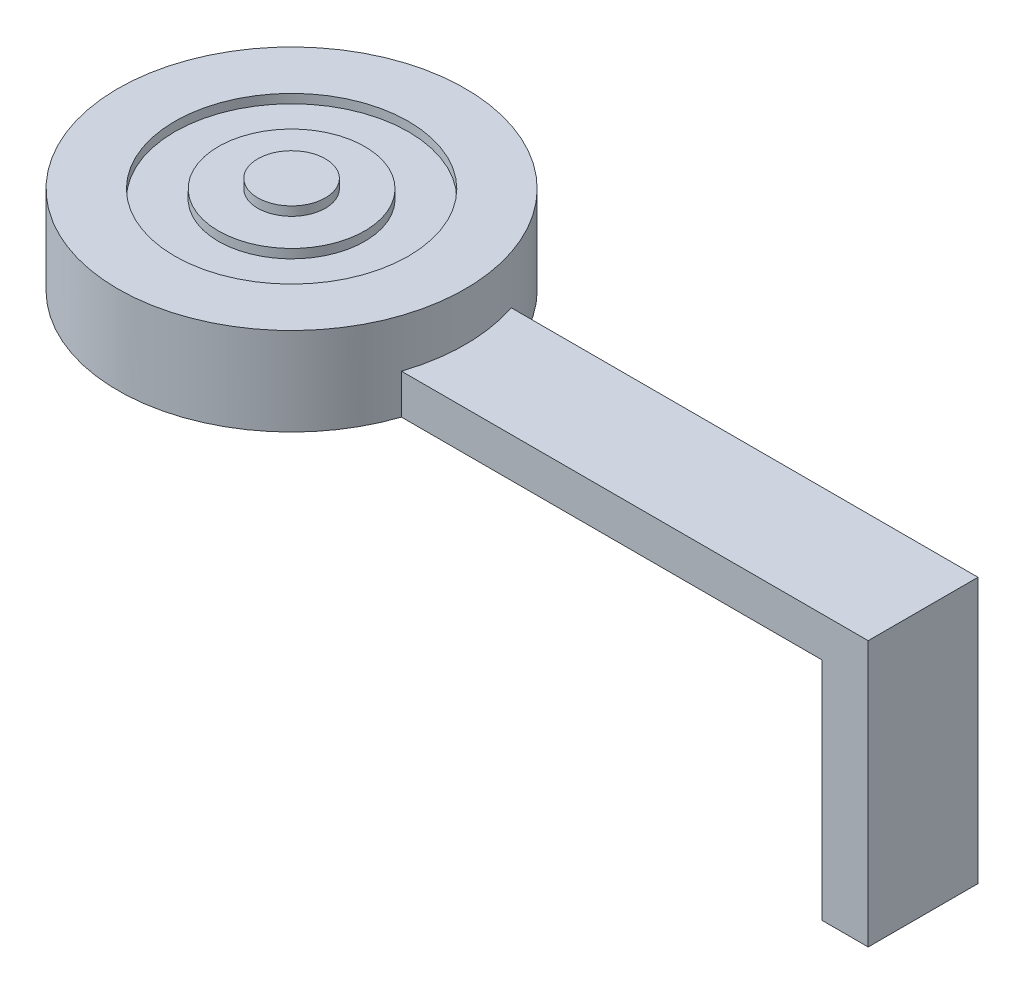
ISO-10303-21;
HEADER;
FILE_DESCRIPTION(('STEP AP214'),'2;1');
FILE_NAME('part.step','',(''),(''),'','','');
FILE_SCHEMA(('AUTOMOTIVE_DESIGN { 1 0 10303 214 1 1 1 1 }'));
ENDSEC;
DATA;
#1=APPLICATION_CONTEXT('core data for automotive mechanical design processes');
#2=APPLICATION_PROTOCOL_DEFINITION('international standard','automotive_design',2000,#1);
#3=PRODUCT_CONTEXT('',#1,'mechanical');
#4=PRODUCT('Part','Part','',(#3));
#5=PRODUCT_RELATED_PRODUCT_CATEGORY('part','',(#4));
#6=PRODUCT_DEFINITION_FORMATION('','',#4);
#7=PRODUCT_DEFINITION_CONTEXT('part definition',#1,'design');
#8=PRODUCT_DEFINITION('design','',#6,#7);
#9=PRODUCT_DEFINITION_SHAPE('','',#8);
#10=(LENGTH_UNIT() NAMED_UNIT(*) SI_UNIT(.MILLI.,.METRE.));
#11=(NAMED_UNIT(*) PLANE_ANGLE_UNIT() SI_UNIT($,.RADIAN.));
#12=(NAMED_UNIT(*) SI_UNIT($,.STERADIAN.) SOLID_ANGLE_UNIT());
#13=UNCERTAINTY_MEASURE_WITH_UNIT(LENGTH_MEASURE(1.E-05),#10,'distance_accuracy_value','');
#14=(GEOMETRIC_REPRESENTATION_CONTEXT(3) GLOBAL_UNCERTAINTY_ASSIGNED_CONTEXT((#13)) GLOBAL_UNIT_ASSIGNED_CONTEXT((#10,
#11,#12)) REPRESENTATION_CONTEXT('',''));
#15=CARTESIAN_POINT('',(0.,0.,0.));
#16=DIRECTION('',(0.,0.,1.));
#17=DIRECTION('',(1.,0.,0.));
#18=AXIS2_PLACEMENT_3D('',#15,#16,#17);
#19=CARTESIAN_POINT('',(0.,0.,0.));
#20=DIRECTION('',(0.,1.,0.));
#21=DIRECTION('',(0.,0.,1.));
#22=AXIS2_PLACEMENT_3D('',#19,#20,#21);
#23=PLANE('',#22);
#24=DIRECTION('',(0.,0.,-1.));
#25=VECTOR('',#24,1.);
#26=CARTESIAN_POINT('',(32.9560858098835,0.,3.09196386115074));
#27=LINE('',#26,#25);
#28=CARTESIAN_POINT('',(32.9560858098835,0.,3.09196386115074));
#29=VERTEX_POINT('',#28);
#30=CARTESIAN_POINT('',(32.9560858098835,0.,-3.09196386115074));
#31=VERTEX_POINT('',#30);
#32=EDGE_CURVE('E48',#29,#31,#27,.T.);
#33=ORIENTED_EDGE('',*,*,#32,.F.);
#34=DIRECTION('',(-1.,0.,0.));
#35=VECTOR('',#34,1.);
#36=CARTESIAN_POINT('',(35.56,0.,3.09196386115074));
#37=LINE('',#36,#35);
#38=CARTESIAN_POINT('',(9.27731644826982,0.,3.09196386115074));
#39=VERTEX_POINT('',#38);
#40=EDGE_CURVE('E123',#29,#39,#37,.T.);
#41=ORIENTED_EDGE('',*,*,#40,.T.);
#42=CARTESIAN_POINT('',(0.,0.,0.));
#43=DIRECTION('',(0.,1.,0.));
#44=DIRECTION('',(0.,0.,1.));
#45=AXIS2_PLACEMENT_3D('',#42,#43,#44);
#46=CIRCLE('',#45,9.779);
#47=CARTESIAN_POINT('',(9.27731644826983,0.,-3.09196386115074));
#48=VERTEX_POINT('',#47);
#49=EDGE_CURVE('E150',#48,#39,#46,.T.);
#50=ORIENTED_EDGE('',*,*,#49,.F.);
#51=DIRECTION('',(-1.,0.,0.));
#52=VECTOR('',#51,1.);
#53=CARTESIAN_POINT('',(35.56,0.,-3.09196386115074));
#54=LINE('',#53,#52);
#55=EDGE_CURVE('E95',#31,#48,#54,.T.);
#56=ORIENTED_EDGE('',*,*,#55,.F.);
#57=EDGE_LOOP('',(#33,#41,#50,#56));
#58=FACE_BOUND('',#57,.T.);
#59=ADVANCED_FACE('F33',(#58),#23,.F.);
#60=CARTESIAN_POINT('',(0.,4.953,0.));
#61=DIRECTION('',(0.,-1.,0.));
#62=DIRECTION('',(0.,0.,-1.));
#63=AXIS2_PLACEMENT_3D('',#60,#61,#62);
#64=CYLINDRICAL_SURFACE('',#63,9.779);
#65=CARTESIAN_POINT('',(0.,4.953,0.));
#66=DIRECTION('',(0.,1.,0.));
#67=DIRECTION('',(0.,0.,1.));
#68=AXIS2_PLACEMENT_3D('',#65,#66,#67);
#69=CIRCLE('',#68,9.779);
#70=CARTESIAN_POINT('',(0.,4.953,9.779));
#71=VERTEX_POINT('',#70);
#72=EDGE_CURVE('E153',#71,#71,#69,.T.);
#73=ORIENTED_EDGE('',*,*,#72,.F.);
#74=EDGE_LOOP('',(#73));
#75=FACE_BOUND('',#74,.T.);
#76=DIRECTION('',(0.,-1.,0.));
#77=VECTOR('',#76,1.);
#78=CARTESIAN_POINT('',(9.27731644826982,4.953,-3.09196386115074));
#79=LINE('',#78,#77);
#80=CARTESIAN_POINT('',(9.27731644826982,2.24020431130132,-3.09196386115074));
#81=VERTEX_POINT('',#80);
#82=EDGE_CURVE('E133',#48,#81,#79,.F.);
#83=ORIENTED_EDGE('',*,*,#82,.F.);
#84=ORIENTED_EDGE('',*,*,#49,.T.);
#85=DIRECTION('',(0.,-1.,0.));
#86=VECTOR('',#85,1.);
#87=CARTESIAN_POINT('',(9.27731644826982,4.953,3.09196386115074));
#88=LINE('',#87,#86);
#89=CARTESIAN_POINT('',(9.27731644826982,2.24020431130132,3.09196386115074));
#90=VERTEX_POINT('',#89);
#91=EDGE_CURVE('E130',#90,#39,#88,.T.);
#92=ORIENTED_EDGE('',*,*,#91,.F.);
#93=CARTESIAN_POINT('',(0.,2.24020431130132,0.));
#94=DIRECTION('',(0.,-1.,0.));
#95=DIRECTION('',(0.,0.,-1.));
#96=AXIS2_PLACEMENT_3D('',#93,#94,#95);
#97=CIRCLE('',#96,9.779);
#98=EDGE_CURVE('E11',#81,#90,#97,.T.);
#99=ORIENTED_EDGE('',*,*,#98,.F.);
#100=EDGE_LOOP('',(#83,#84,#92,#99));
#101=FACE_BOUND('',#100,.T.);
#102=ADVANCED_FACE('F35',(#75,#101),#64,.T.);
#103=CARTESIAN_POINT('',(0.,4.953,0.));
#104=DIRECTION('',(0.,1.,0.));
#105=DIRECTION('',(0.,0.,1.));
#106=AXIS2_PLACEMENT_3D('',#103,#104,#105);
#107=PLANE('',#106);
#108=CARTESIAN_POINT('',(0.,4.953,0.));
#109=DIRECTION('',(0.,1.,0.));
#110=DIRECTION('',(0.,0.,1.));
#111=AXIS2_PLACEMENT_3D('',#108,#109,#110);
#112=CIRCLE('',#111,6.57857427581496);
#113=CARTESIAN_POINT('',(0.,4.953,6.57857427581496));
#114=VERTEX_POINT('',#113);
#115=EDGE_CURVE('E139',#114,#114,#112,.T.);
#116=ORIENTED_EDGE('',*,*,#115,.F.);
#117=EDGE_LOOP('',(#116));
#118=FACE_BOUND('',#117,.T.);
#119=ORIENTED_EDGE('',*,*,#72,.T.);
#120=EDGE_LOOP('',(#119));
#121=FACE_BOUND('',#120,.T.);
#122=ADVANCED_FACE('F177',(#118,#121),#107,.T.);
#123=CARTESIAN_POINT('',(0.,4.445,0.));
#124=DIRECTION('',(0.,1.,0.));
#125=DIRECTION('',(0.,0.,1.));
#126=AXIS2_PLACEMENT_3D('',#123,#124,#125);
#127=CYLINDRICAL_SURFACE('',#126,6.57857427581496);
#128=CARTESIAN_POINT('',(0.,4.445,0.));
#129=DIRECTION('',(0.,1.,0.));
#130=DIRECTION('',(0.,0.,1.));
#131=AXIS2_PLACEMENT_3D('',#128,#129,#130);
#132=CIRCLE('',#131,6.57857427581496);
#133=CARTESIAN_POINT('',(0.,4.445,6.57857427581496));
#134=VERTEX_POINT('',#133);
#135=EDGE_CURVE('E142',#134,#134,#132,.T.);
#136=ORIENTED_EDGE('',*,*,#135,.F.);
#137=EDGE_LOOP('',(#136));
#138=FACE_BOUND('',#137,.T.);
#139=ORIENTED_EDGE('',*,*,#115,.T.);
#140=EDGE_LOOP('',(#139));
#141=FACE_BOUND('',#140,.T.);
#142=ADVANCED_FACE('F182',(#138,#141),#127,.F.);
#143=CARTESIAN_POINT('',(0.,4.445,0.));
#144=DIRECTION('',(0.,1.,0.));
#145=DIRECTION('',(0.,0.,1.));
#146=AXIS2_PLACEMENT_3D('',#143,#144,#145);
#147=PLANE('',#146);
#148=CARTESIAN_POINT('',(0.,4.445,0.));
#149=DIRECTION('',(0.,1.,0.));
#150=DIRECTION('',(0.,0.,1.));
#151=AXIS2_PLACEMENT_3D('',#148,#149,#150);
#152=CIRCLE('',#151,4.11966581073518);
#153=CARTESIAN_POINT('',(0.,4.445,4.11966581073518));
#154=VERTEX_POINT('',#153);
#155=EDGE_CURVE('E136',#154,#154,#152,.T.);
#156=ORIENTED_EDGE('',*,*,#155,.F.);
#157=EDGE_LOOP('',(#156));
#158=FACE_BOUND('',#157,.T.);
#159=ORIENTED_EDGE('',*,*,#135,.T.);
#160=EDGE_LOOP('',(#159));
#161=FACE_BOUND('',#160,.T.);
#162=ADVANCED_FACE('F196',(#158,#161),#147,.T.);
#163=CARTESIAN_POINT('',(0.,4.445,0.));
#164=DIRECTION('',(0.,1.,0.));
#165=DIRECTION('',(0.,0.,1.));
#166=AXIS2_PLACEMENT_3D('',#163,#164,#165);
#167=CYLINDRICAL_SURFACE('',#166,4.11966581073518);
#168=ORIENTED_EDGE('',*,*,#155,.T.);
#169=EDGE_LOOP('',(#168));
#170=FACE_BOUND('',#169,.T.);
#171=CARTESIAN_POINT('',(0.,4.953,0.));
#172=DIRECTION('',(0.,1.,0.));
#173=DIRECTION('',(0.,0.,1.));
#174=AXIS2_PLACEMENT_3D('',#171,#172,#173);
#175=CIRCLE('',#174,4.11966581073518);
#176=CARTESIAN_POINT('',(0.,4.953,4.11966581073518));
#177=VERTEX_POINT('',#176);
#178=EDGE_CURVE('E135',#177,#177,#175,.T.);
#179=ORIENTED_EDGE('',*,*,#178,.F.);
#180=EDGE_LOOP('',(#179));
#181=FACE_BOUND('',#180,.T.);
#182=ADVANCED_FACE('F192',(#170,#181),#167,.T.);
#183=CARTESIAN_POINT('',(0.,5.461,0.));
#184=DIRECTION('',(0.,1.,0.));
#185=DIRECTION('',(0.,0.,1.));
#186=AXIS2_PLACEMENT_3D('',#183,#184,#185);
#187=PLANE('',#186);
#188=CARTESIAN_POINT('',(0.,5.461,0.));
#189=DIRECTION('',(0.,1.,0.));
#190=DIRECTION('',(0.,0.,1.));
#191=AXIS2_PLACEMENT_3D('',#188,#189,#190);
#192=CIRCLE('',#191,1.905);
#193=CARTESIAN_POINT('',(0.,5.461,1.905));
#194=VERTEX_POINT('',#193);
#195=EDGE_CURVE('E145',#194,#194,#192,.T.);
#196=ORIENTED_EDGE('',*,*,#195,.T.);
#197=EDGE_LOOP('',(#196));
#198=FACE_BOUND('',#197,.T.);
#199=ADVANCED_FACE('F188',(#198),#187,.T.);
#200=CARTESIAN_POINT('',(0.,5.461,0.));
#201=DIRECTION('',(0.,-1.,0.));
#202=DIRECTION('',(0.,0.,-1.));
#203=AXIS2_PLACEMENT_3D('',#200,#201,#202);
#204=CYLINDRICAL_SURFACE('',#203,1.905);
#205=ORIENTED_EDGE('',*,*,#195,.F.);
#206=EDGE_LOOP('',(#205));
#207=FACE_BOUND('',#206,.T.);
#208=CARTESIAN_POINT('',(0.,4.953,0.));
#209=DIRECTION('',(0.,1.,0.));
#210=DIRECTION('',(0.,0.,1.));
#211=AXIS2_PLACEMENT_3D('',#208,#209,#210);
#212=CIRCLE('',#211,1.905);
#213=CARTESIAN_POINT('',(0.,4.953,1.905));
#214=VERTEX_POINT('',#213);
#215=EDGE_CURVE('E41',#214,#214,#212,.T.);
#216=ORIENTED_EDGE('',*,*,#215,.T.);
#217=EDGE_LOOP('',(#216));
#218=FACE_BOUND('',#217,.T.);
#219=ADVANCED_FACE('F185',(#207,#218),#204,.T.);
#220=ORIENTED_EDGE('',*,*,#215,.F.);
#221=EDGE_LOOP('',(#220));
#222=FACE_BOUND('',#221,.T.);
#223=ORIENTED_EDGE('',*,*,#178,.T.);
#224=EDGE_LOOP('',(#223));
#225=FACE_BOUND('',#224,.T.);
#226=ADVANCED_FACE('F184',(#222,#225),#107,.T.);
#227=CARTESIAN_POINT('',(35.56,2.24020431130132,-3.09196386115074));
#228=DIRECTION('',(0.,0.,1.));
#229=DIRECTION('',(1.,0.,0.));
#230=AXIS2_PLACEMENT_3D('',#227,#228,#229);
#231=PLANE('',#230);
#232=DIRECTION('',(0.,1.,0.));
#233=VECTOR('',#232,1.);
#234=CARTESIAN_POINT('',(35.56,2.24020431130132,-3.09196386115074));
#235=LINE('',#234,#233);
#236=CARTESIAN_POINT('',(35.56,-12.7,-3.09196386115074));
#237=VERTEX_POINT('',#236);
#238=CARTESIAN_POINT('',(35.56,2.24020431130132,-3.09196386115074));
#239=VERTEX_POINT('',#238);
#240=EDGE_CURVE('E119',#237,#239,#235,.T.);
#241=ORIENTED_EDGE('',*,*,#240,.F.);
#242=DIRECTION('',(1.,0.,0.));
#243=VECTOR('',#242,1.);
#244=CARTESIAN_POINT('',(35.56,-12.7,-3.09196386115074));
#245=LINE('',#244,#243);
#246=CARTESIAN_POINT('',(32.9560858098835,-12.7,-3.09196386115074));
#247=VERTEX_POINT('',#246);
#248=EDGE_CURVE('E109',#247,#237,#245,.T.);
#249=ORIENTED_EDGE('',*,*,#248,.F.);
#250=DIRECTION('',(0.,1.,0.));
#251=VECTOR('',#250,1.);
#252=CARTESIAN_POINT('',(32.9560858098835,-12.7,-3.09196386115074));
#253=LINE('',#252,#251);
#254=EDGE_CURVE('E114',#247,#31,#253,.T.);
#255=ORIENTED_EDGE('',*,*,#254,.T.);
#256=ORIENTED_EDGE('',*,*,#55,.T.);
#257=ORIENTED_EDGE('',*,*,#82,.T.);
#258=DIRECTION('',(-1.,0.,0.));
#259=VECTOR('',#258,1.);
#260=CARTESIAN_POINT('',(35.56,2.24020431130132,-3.09196386115074));
#261=LINE('',#260,#259);
#262=EDGE_CURVE('E127',#239,#81,#261,.T.);
#263=ORIENTED_EDGE('',*,*,#262,.F.);
#264=EDGE_LOOP('',(#241,#249,#255,#256,#257,#263));
#265=FACE_BOUND('',#264,.T.);
#266=ADVANCED_FACE('F161',(#265),#231,.F.);
#267=CARTESIAN_POINT('',(35.56,2.24020431130132,3.09196386115074));
#268=DIRECTION('',(0.,0.,-1.));
#269=DIRECTION('',(-1.,0.,0.));
#270=AXIS2_PLACEMENT_3D('',#267,#268,#269);
#271=PLANE('',#270);
#272=DIRECTION('',(-1.,0.,0.));
#273=VECTOR('',#272,1.);
#274=CARTESIAN_POINT('',(35.56,2.24020431130132,3.09196386115074));
#275=LINE('',#274,#273);
#276=CARTESIAN_POINT('',(35.56,2.24020431130132,3.09196386115074));
#277=VERTEX_POINT('',#276);
#278=EDGE_CURVE('E125',#277,#90,#275,.T.);
#279=ORIENTED_EDGE('',*,*,#278,.T.);
#280=ORIENTED_EDGE('',*,*,#91,.T.);
#281=ORIENTED_EDGE('',*,*,#40,.F.);
#282=DIRECTION('',(0.,1.,0.));
#283=VECTOR('',#282,1.);
#284=CARTESIAN_POINT('',(32.9560858098835,-12.7,3.09196386115074));
#285=LINE('',#284,#283);
#286=CARTESIAN_POINT('',(32.9560858098835,-12.7,3.09196386115074));
#287=VERTEX_POINT('',#286);
#288=EDGE_CURVE('E101',#287,#29,#285,.T.);
#289=ORIENTED_EDGE('',*,*,#288,.F.);
#290=DIRECTION('',(-1.,0.,0.));
#291=VECTOR('',#290,1.);
#292=CARTESIAN_POINT('',(35.56,-12.7,3.09196386115074));
#293=LINE('',#292,#291);
#294=CARTESIAN_POINT('',(35.56,-12.7,3.09196386115074));
#295=VERTEX_POINT('',#294);
#296=EDGE_CURVE('E98',#295,#287,#293,.T.);
#297=ORIENTED_EDGE('',*,*,#296,.F.);
#298=DIRECTION('',(0.,-1.,0.));
#299=VECTOR('',#298,1.);
#300=CARTESIAN_POINT('',(35.56,2.24020431130132,3.09196386115074));
#301=LINE('',#300,#299);
#302=EDGE_CURVE('E85',#277,#295,#301,.T.);
#303=ORIENTED_EDGE('',*,*,#302,.F.);
#304=EDGE_LOOP('',(#279,#280,#281,#289,#297,#303));
#305=FACE_BOUND('',#304,.T.);
#306=ADVANCED_FACE('F99',(#305),#271,.F.);
#307=CARTESIAN_POINT('',(35.56,2.24020431130132,3.09196386115074));
#308=DIRECTION('',(0.,-1.,0.));
#309=DIRECTION('',(0.,0.,-1.));
#310=AXIS2_PLACEMENT_3D('',#307,#308,#309);
#311=PLANE('',#310);
#312=ORIENTED_EDGE('',*,*,#262,.T.);
#313=ORIENTED_EDGE('',*,*,#98,.T.);
#314=ORIENTED_EDGE('',*,*,#278,.F.);
#315=DIRECTION('',(0.,0.,1.));
#316=VECTOR('',#315,1.);
#317=CARTESIAN_POINT('',(35.56,2.24020431130132,3.09196386115074));
#318=LINE('',#317,#316);
#319=EDGE_CURVE('E91',#239,#277,#318,.T.);
#320=ORIENTED_EDGE('',*,*,#319,.F.);
#321=EDGE_LOOP('',(#312,#313,#314,#320));
#322=FACE_BOUND('',#321,.T.);
#323=ADVANCED_FACE('F158',(#322),#311,.F.);
#324=CARTESIAN_POINT('',(35.56,0.,0.));
#325=DIRECTION('',(1.,0.,0.));
#326=DIRECTION('',(0.,0.,-1.));
#327=AXIS2_PLACEMENT_3D('',#324,#325,#326);
#328=PLANE('',#327);
#329=ORIENTED_EDGE('',*,*,#240,.T.);
#330=ORIENTED_EDGE('',*,*,#319,.T.);
#331=ORIENTED_EDGE('',*,*,#302,.T.);
#332=DIRECTION('',(0.,0.,1.));
#333=VECTOR('',#332,1.);
#334=CARTESIAN_POINT('',(35.56,-12.7,3.09196386115074));
#335=LINE('',#334,#333);
#336=EDGE_CURVE('E90',#237,#295,#335,.T.);
#337=ORIENTED_EDGE('',*,*,#336,.F.);
#338=EDGE_LOOP('',(#329,#330,#331,#337));
#339=FACE_BOUND('',#338,.T.);
#340=ADVANCED_FACE('F88',(#339),#328,.T.);
#341=CARTESIAN_POINT('',(32.9560858098835,-12.7,3.09196386115074));
#342=DIRECTION('',(1.,0.,0.));
#343=DIRECTION('',(0.,0.,-1.));
#344=AXIS2_PLACEMENT_3D('',#341,#342,#343);
#345=PLANE('',#344);
#346=ORIENTED_EDGE('',*,*,#32,.T.);
#347=ORIENTED_EDGE('',*,*,#254,.F.);
#348=DIRECTION('',(0.,0.,-1.));
#349=VECTOR('',#348,1.);
#350=CARTESIAN_POINT('',(32.9560858098835,-12.7,3.09196386115074));
#351=LINE('',#350,#349);
#352=EDGE_CURVE('E104',#287,#247,#351,.T.);
#353=ORIENTED_EDGE('',*,*,#352,.F.);
#354=ORIENTED_EDGE('',*,*,#288,.T.);
#355=EDGE_LOOP('',(#346,#347,#353,#354));
#356=FACE_BOUND('',#355,.T.);
#357=ADVANCED_FACE('F164',(#356),#345,.F.);
#358=CARTESIAN_POINT('',(0.,-12.7,0.));
#359=DIRECTION('',(0.,1.,0.));
#360=DIRECTION('',(0.,0.,1.));
#361=AXIS2_PLACEMENT_3D('',#358,#359,#360);
#362=PLANE('',#361);
#363=ORIENTED_EDGE('',*,*,#336,.T.);
#364=ORIENTED_EDGE('',*,*,#296,.T.);
#365=ORIENTED_EDGE('',*,*,#352,.T.);
#366=ORIENTED_EDGE('',*,*,#248,.T.);
#367=EDGE_LOOP('',(#363,#364,#365,#366));
#368=FACE_BOUND('',#367,.T.);
#369=ADVANCED_FACE('F107',(#368),#362,.F.);
#370=CLOSED_SHELL('',(#59,#102,#122,#142,#162,#182,#199,#219,#226,#266,#306,#323,#340,#357,#369));
#371=MANIFOLD_SOLID_BREP('B2',#370);
#372=ADVANCED_BREP_SHAPE_REPRESENTATION('',(#18,#371),#14);
#373=SHAPE_DEFINITION_REPRESENTATION(#9,#372);
ENDSEC;
END-ISO-10303-21;
